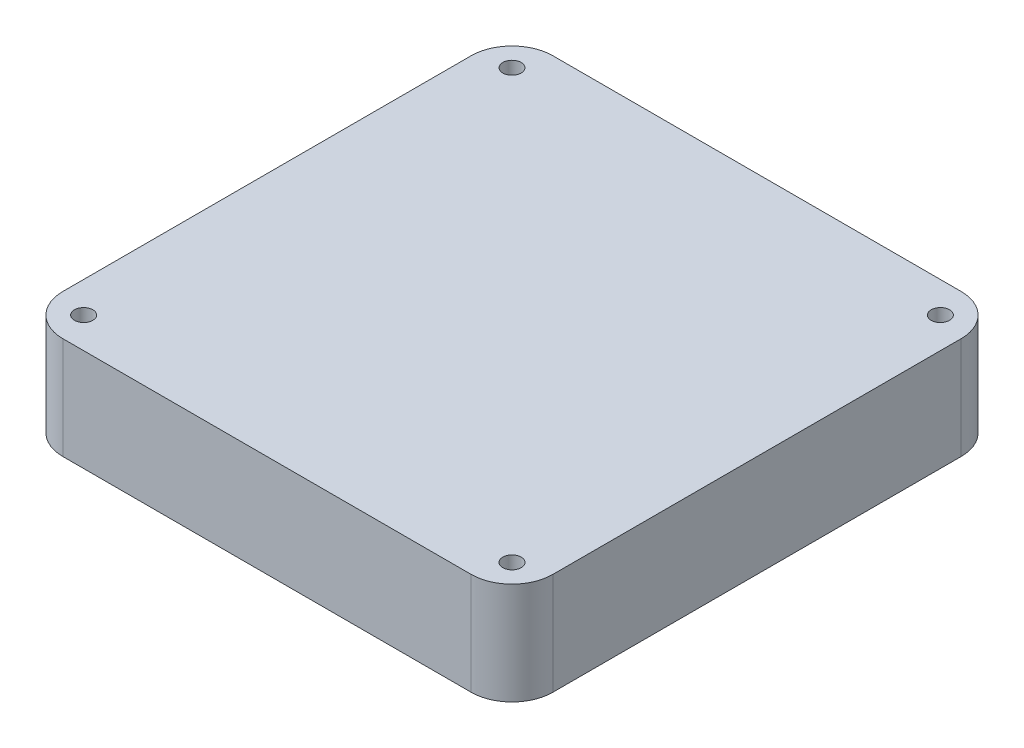
ISO-10303-21;
HEADER;
FILE_DESCRIPTION(('STEP AP214'),'2;1');
FILE_NAME('part.step','',(''),(''),'','','');
FILE_SCHEMA(('AUTOMOTIVE_DESIGN { 1 0 10303 214 1 1 1 1 }'));
ENDSEC;
DATA;
#1=APPLICATION_CONTEXT('core data for automotive mechanical design processes');
#2=APPLICATION_PROTOCOL_DEFINITION('international standard','automotive_design',2000,#1);
#3=PRODUCT_CONTEXT('',#1,'mechanical');
#4=PRODUCT('Part','Part','',(#3));
#5=PRODUCT_RELATED_PRODUCT_CATEGORY('part','',(#4));
#6=PRODUCT_DEFINITION_FORMATION('','',#4);
#7=PRODUCT_DEFINITION_CONTEXT('part definition',#1,'design');
#8=PRODUCT_DEFINITION('design','',#6,#7);
#9=PRODUCT_DEFINITION_SHAPE('','',#8);
#10=(LENGTH_UNIT() NAMED_UNIT(*) SI_UNIT(.MILLI.,.METRE.));
#11=(NAMED_UNIT(*) PLANE_ANGLE_UNIT() SI_UNIT($,.RADIAN.));
#12=(NAMED_UNIT(*) SI_UNIT($,.STERADIAN.) SOLID_ANGLE_UNIT());
#13=UNCERTAINTY_MEASURE_WITH_UNIT(LENGTH_MEASURE(1.E-05),#10,'distance_accuracy_value','');
#14=(GEOMETRIC_REPRESENTATION_CONTEXT(3) GLOBAL_UNCERTAINTY_ASSIGNED_CONTEXT((#13)) GLOBAL_UNIT_ASSIGNED_CONTEXT((#10,
#11,#12)) REPRESENTATION_CONTEXT('',''));
#15=CARTESIAN_POINT('',(0.,0.,0.));
#16=DIRECTION('',(0.,0.,1.));
#17=DIRECTION('',(1.,0.,0.));
#18=AXIS2_PLACEMENT_3D('',#15,#16,#17);
#19=CARTESIAN_POINT('',(0.,25.,0.));
#20=DIRECTION('',(0.,-1.,0.));
#21=DIRECTION('',(0.,0.,-1.));
#22=AXIS2_PLACEMENT_3D('',#19,#20,#21);
#23=PLANE('',#22);
#24=DIRECTION('',(-1.,0.,0.));
#25=VECTOR('',#24,1.);
#26=CARTESIAN_POINT('',(0.,25.,-120.));
#27=LINE('',#26,#25);
#28=CARTESIAN_POINT('',(110.,25.,-120.));
#29=VERTEX_POINT('',#28);
#30=CARTESIAN_POINT('',(10.,25.,-120.));
#31=VERTEX_POINT('',#30);
#32=EDGE_CURVE('E148',#29,#31,#27,.T.);
#33=ORIENTED_EDGE('',*,*,#32,.T.);
#34=CARTESIAN_POINT('',(10.,25.,-110.));
#35=DIRECTION('',(0.,-1.,0.));
#36=DIRECTION('',(0.,0.,-1.));
#37=AXIS2_PLACEMENT_3D('',#34,#35,#36);
#38=CIRCLE('',#37,10.);
#39=CARTESIAN_POINT('',(0.,25.,-110.));
#40=VERTEX_POINT('',#39);
#41=EDGE_CURVE('E178',#31,#40,#38,.F.);
#42=ORIENTED_EDGE('',*,*,#41,.T.);
#43=DIRECTION('',(0.,0.,1.));
#44=VECTOR('',#43,1.);
#45=CARTESIAN_POINT('',(0.,25.,0.));
#46=LINE('',#45,#44);
#47=CARTESIAN_POINT('',(0.,25.,-10.));
#48=VERTEX_POINT('',#47);
#49=EDGE_CURVE('E127',#40,#48,#46,.T.);
#50=ORIENTED_EDGE('',*,*,#49,.T.);
#51=CARTESIAN_POINT('',(10.,25.,-10.));
#52=DIRECTION('',(0.,-1.,0.));
#53=DIRECTION('',(0.,0.,-1.));
#54=AXIS2_PLACEMENT_3D('',#51,#52,#53);
#55=CIRCLE('',#54,10.);
#56=CARTESIAN_POINT('',(10.,25.,0.));
#57=VERTEX_POINT('',#56);
#58=EDGE_CURVE('E170',#48,#57,#55,.F.);
#59=ORIENTED_EDGE('',*,*,#58,.T.);
#60=DIRECTION('',(1.,0.,0.));
#61=VECTOR('',#60,1.);
#62=CARTESIAN_POINT('',(0.,25.,0.));
#63=LINE('',#62,#61);
#64=CARTESIAN_POINT('',(110.,25.,0.));
#65=VERTEX_POINT('',#64);
#66=EDGE_CURVE('E193',#57,#65,#63,.T.);
#67=ORIENTED_EDGE('',*,*,#66,.T.);
#68=CARTESIAN_POINT('',(110.,25.,-10.));
#69=DIRECTION('',(0.,-1.,0.));
#70=DIRECTION('',(0.,0.,-1.));
#71=AXIS2_PLACEMENT_3D('',#68,#69,#70);
#72=CIRCLE('',#71,10.);
#73=CARTESIAN_POINT('',(120.,25.,-10.));
#74=VERTEX_POINT('',#73);
#75=EDGE_CURVE('E62',#65,#74,#72,.F.);
#76=ORIENTED_EDGE('',*,*,#75,.T.);
#77=DIRECTION('',(0.,0.,-1.));
#78=VECTOR('',#77,1.);
#79=CARTESIAN_POINT('',(120.,25.,0.));
#80=LINE('',#79,#78);
#81=CARTESIAN_POINT('',(120.,25.,-110.));
#82=VERTEX_POINT('',#81);
#83=EDGE_CURVE('E201',#74,#82,#80,.T.);
#84=ORIENTED_EDGE('',*,*,#83,.T.);
#85=CARTESIAN_POINT('',(110.,25.,-110.));
#86=DIRECTION('',(0.,-1.,0.));
#87=DIRECTION('',(0.,0.,-1.));
#88=AXIS2_PLACEMENT_3D('',#85,#86,#87);
#89=CIRCLE('',#88,10.);
#90=EDGE_CURVE('E175',#82,#29,#89,.F.);
#91=ORIENTED_EDGE('',*,*,#90,.T.);
#92=EDGE_LOOP('',(#33,#42,#50,#59,#67,#76,#84,#91));
#93=FACE_BOUND('',#92,.T.);
#94=CARTESIAN_POINT('',(7.55,25.,-112.45));
#95=DIRECTION('',(0.,1.,0.));
#96=DIRECTION('',(0.,0.,1.));
#97=AXIS2_PLACEMENT_3D('',#94,#95,#96);
#98=CIRCLE('',#97,2.25);
#99=CARTESIAN_POINT('',(7.55,25.,-110.2));
#100=VERTEX_POINT('',#99);
#101=EDGE_CURVE('E137',#100,#100,#98,.T.);
#102=ORIENTED_EDGE('',*,*,#101,.F.);
#103=EDGE_LOOP('',(#102));
#104=FACE_BOUND('',#103,.T.);
#105=CARTESIAN_POINT('',(112.45,25.,-112.45));
#106=DIRECTION('',(0.,1.,0.));
#107=DIRECTION('',(0.,0.,1.));
#108=AXIS2_PLACEMENT_3D('',#105,#106,#107);
#109=CIRCLE('',#108,2.25);
#110=CARTESIAN_POINT('',(112.45,25.,-110.2));
#111=VERTEX_POINT('',#110);
#112=EDGE_CURVE('E213',#111,#111,#109,.T.);
#113=ORIENTED_EDGE('',*,*,#112,.F.);
#114=EDGE_LOOP('',(#113));
#115=FACE_BOUND('',#114,.T.);
#116=CARTESIAN_POINT('',(112.45,25.,-7.55));
#117=DIRECTION('',(0.,1.,0.));
#118=DIRECTION('',(0.,0.,1.));
#119=AXIS2_PLACEMENT_3D('',#116,#117,#118);
#120=CIRCLE('',#119,2.25);
#121=CARTESIAN_POINT('',(112.45,25.,-5.3));
#122=VERTEX_POINT('',#121);
#123=EDGE_CURVE('E219',#122,#122,#120,.T.);
#124=ORIENTED_EDGE('',*,*,#123,.F.);
#125=EDGE_LOOP('',(#124));
#126=FACE_BOUND('',#125,.T.);
#127=CARTESIAN_POINT('',(7.55,25.,-7.55));
#128=DIRECTION('',(0.,1.,0.));
#129=DIRECTION('',(0.,0.,1.));
#130=AXIS2_PLACEMENT_3D('',#127,#128,#129);
#131=CIRCLE('',#130,2.25);
#132=CARTESIAN_POINT('',(7.55,25.,-5.29999999999999));
#133=VERTEX_POINT('',#132);
#134=EDGE_CURVE('E227',#133,#133,#131,.T.);
#135=ORIENTED_EDGE('',*,*,#134,.F.);
#136=EDGE_LOOP('',(#135));
#137=FACE_BOUND('',#136,.T.);
#138=ADVANCED_FACE('F39',(#93,#104,#115,#126,#137),#23,.F.);
#139=CARTESIAN_POINT('',(0.,0.,0.));
#140=DIRECTION('',(0.,-1.,0.));
#141=DIRECTION('',(0.,0.,-1.));
#142=AXIS2_PLACEMENT_3D('',#139,#140,#141);
#143=PLANE('',#142);
#144=CARTESIAN_POINT('',(112.45,0.,-7.55));
#145=DIRECTION('',(0.,1.,0.));
#146=DIRECTION('',(0.,0.,1.));
#147=AXIS2_PLACEMENT_3D('',#144,#145,#146);
#148=CIRCLE('',#147,2.25);
#149=CARTESIAN_POINT('',(112.45,0.,-5.3));
#150=VERTEX_POINT('',#149);
#151=EDGE_CURVE('E223',#150,#150,#148,.T.);
#152=ORIENTED_EDGE('',*,*,#151,.T.);
#153=EDGE_LOOP('',(#152));
#154=FACE_BOUND('',#153,.T.);
#155=CARTESIAN_POINT('',(7.55,0.,-112.45));
#156=DIRECTION('',(0.,1.,0.));
#157=DIRECTION('',(0.,0.,1.));
#158=AXIS2_PLACEMENT_3D('',#155,#156,#157);
#159=CIRCLE('',#158,2.25);
#160=CARTESIAN_POINT('',(7.55,0.,-110.2));
#161=VERTEX_POINT('',#160);
#162=EDGE_CURVE('E145',#161,#161,#159,.T.);
#163=ORIENTED_EDGE('',*,*,#162,.T.);
#164=EDGE_LOOP('',(#163));
#165=FACE_BOUND('',#164,.T.);
#166=DIRECTION('',(0.,0.,1.));
#167=VECTOR('',#166,1.);
#168=CARTESIAN_POINT('',(0.,0.,0.));
#169=LINE('',#168,#167);
#170=CARTESIAN_POINT('',(0.,0.,-110.));
#171=VERTEX_POINT('',#170);
#172=CARTESIAN_POINT('',(0.,0.,-10.));
#173=VERTEX_POINT('',#172);
#174=EDGE_CURVE('E124',#171,#173,#169,.T.);
#175=ORIENTED_EDGE('',*,*,#174,.F.);
#176=CARTESIAN_POINT('',(10.,0.,-110.));
#177=DIRECTION('',(0.,-1.,0.));
#178=DIRECTION('',(0.,0.,-1.));
#179=AXIS2_PLACEMENT_3D('',#176,#177,#178);
#180=CIRCLE('',#179,10.);
#181=CARTESIAN_POINT('',(10.,0.,-120.));
#182=VERTEX_POINT('',#181);
#183=EDGE_CURVE('E106',#171,#182,#180,.T.);
#184=ORIENTED_EDGE('',*,*,#183,.T.);
#185=DIRECTION('',(-1.,0.,0.));
#186=VECTOR('',#185,1.);
#187=CARTESIAN_POINT('',(0.,0.,-120.));
#188=LINE('',#187,#186);
#189=CARTESIAN_POINT('',(110.,0.,-120.));
#190=VERTEX_POINT('',#189);
#191=EDGE_CURVE('E153',#190,#182,#188,.T.);
#192=ORIENTED_EDGE('',*,*,#191,.F.);
#193=CARTESIAN_POINT('',(110.,0.,-110.));
#194=DIRECTION('',(0.,-1.,0.));
#195=DIRECTION('',(0.,0.,-1.));
#196=AXIS2_PLACEMENT_3D('',#193,#194,#195);
#197=CIRCLE('',#196,10.);
#198=CARTESIAN_POINT('',(120.,0.,-110.));
#199=VERTEX_POINT('',#198);
#200=EDGE_CURVE('E118',#190,#199,#197,.T.);
#201=ORIENTED_EDGE('',*,*,#200,.T.);
#202=DIRECTION('',(0.,0.,-1.));
#203=VECTOR('',#202,1.);
#204=CARTESIAN_POINT('',(120.,0.,0.));
#205=LINE('',#204,#203);
#206=CARTESIAN_POINT('',(120.,0.,-10.));
#207=VERTEX_POINT('',#206);
#208=EDGE_CURVE('E142',#207,#199,#205,.T.);
#209=ORIENTED_EDGE('',*,*,#208,.F.);
#210=CARTESIAN_POINT('',(110.,0.,-10.));
#211=DIRECTION('',(0.,-1.,0.));
#212=DIRECTION('',(0.,0.,-1.));
#213=AXIS2_PLACEMENT_3D('',#210,#211,#212);
#214=CIRCLE('',#213,10.);
#215=CARTESIAN_POINT('',(110.,0.,0.));
#216=VERTEX_POINT('',#215);
#217=EDGE_CURVE('E160',#207,#216,#214,.T.);
#218=ORIENTED_EDGE('',*,*,#217,.T.);
#219=DIRECTION('',(1.,0.,0.));
#220=VECTOR('',#219,1.);
#221=CARTESIAN_POINT('',(0.,0.,0.));
#222=LINE('',#221,#220);
#223=CARTESIAN_POINT('',(10.,0.,0.));
#224=VERTEX_POINT('',#223);
#225=EDGE_CURVE('E136',#224,#216,#222,.T.);
#226=ORIENTED_EDGE('',*,*,#225,.F.);
#227=CARTESIAN_POINT('',(10.,0.,-10.));
#228=DIRECTION('',(0.,-1.,0.));
#229=DIRECTION('',(0.,0.,-1.));
#230=AXIS2_PLACEMENT_3D('',#227,#228,#229);
#231=CIRCLE('',#230,10.);
#232=EDGE_CURVE('E129',#224,#173,#231,.T.);
#233=ORIENTED_EDGE('',*,*,#232,.T.);
#234=EDGE_LOOP('',(#175,#184,#192,#201,#209,#218,#226,#233));
#235=FACE_BOUND('',#234,.T.);
#236=CARTESIAN_POINT('',(112.45,0.,-112.45));
#237=DIRECTION('',(0.,1.,0.));
#238=DIRECTION('',(0.,0.,1.));
#239=AXIS2_PLACEMENT_3D('',#236,#237,#238);
#240=CIRCLE('',#239,2.25);
#241=CARTESIAN_POINT('',(112.45,0.,-110.2));
#242=VERTEX_POINT('',#241);
#243=EDGE_CURVE('E215',#242,#242,#240,.T.);
#244=ORIENTED_EDGE('',*,*,#243,.T.);
#245=EDGE_LOOP('',(#244));
#246=FACE_BOUND('',#245,.T.);
#247=CARTESIAN_POINT('',(7.55,0.,-7.55));
#248=DIRECTION('',(0.,1.,0.));
#249=DIRECTION('',(0.,0.,1.));
#250=AXIS2_PLACEMENT_3D('',#247,#248,#249);
#251=CIRCLE('',#250,2.25);
#252=CARTESIAN_POINT('',(7.55,0.,-5.29999999999999));
#253=VERTEX_POINT('',#252);
#254=EDGE_CURVE('E231',#253,#253,#251,.T.);
#255=ORIENTED_EDGE('',*,*,#254,.T.);
#256=EDGE_LOOP('',(#255));
#257=FACE_BOUND('',#256,.T.);
#258=ADVANCED_FACE('F132',(#154,#165,#235,#246,#257),#143,.T.);
#259=CARTESIAN_POINT('',(0.,25.,0.));
#260=DIRECTION('',(1.,0.,0.));
#261=DIRECTION('',(0.,0.,-1.));
#262=AXIS2_PLACEMENT_3D('',#259,#260,#261);
#263=PLANE('',#262);
#264=ORIENTED_EDGE('',*,*,#49,.F.);
#265=DIRECTION('',(0.,-1.,0.));
#266=VECTOR('',#265,1.);
#267=CARTESIAN_POINT('',(0.,25.,-110.));
#268=LINE('',#267,#266);
#269=EDGE_CURVE('E110',#40,#171,#268,.T.);
#270=ORIENTED_EDGE('',*,*,#269,.T.);
#271=ORIENTED_EDGE('',*,*,#174,.T.);
#272=DIRECTION('',(0.,-1.,0.));
#273=VECTOR('',#272,1.);
#274=CARTESIAN_POINT('',(0.,25.,-10.));
#275=LINE('',#274,#273);
#276=EDGE_CURVE('E130',#173,#48,#275,.F.);
#277=ORIENTED_EDGE('',*,*,#276,.T.);
#278=EDGE_LOOP('',(#264,#270,#271,#277));
#279=FACE_BOUND('',#278,.T.);
#280=ADVANCED_FACE('F123',(#279),#263,.F.);
#281=CARTESIAN_POINT('',(0.,25.,0.));
#282=DIRECTION('',(0.,0.,-1.));
#283=DIRECTION('',(-1.,0.,0.));
#284=AXIS2_PLACEMENT_3D('',#281,#282,#283);
#285=PLANE('',#284);
#286=ORIENTED_EDGE('',*,*,#225,.T.);
#287=DIRECTION('',(0.,-1.,0.));
#288=VECTOR('',#287,1.);
#289=CARTESIAN_POINT('',(110.,25.,0.));
#290=LINE('',#289,#288);
#291=EDGE_CURVE('E11',#216,#65,#290,.F.);
#292=ORIENTED_EDGE('',*,*,#291,.T.);
#293=ORIENTED_EDGE('',*,*,#66,.F.);
#294=DIRECTION('',(0.,-1.,0.));
#295=VECTOR('',#294,1.);
#296=CARTESIAN_POINT('',(10.,25.,0.));
#297=LINE('',#296,#295);
#298=EDGE_CURVE('E48',#57,#224,#297,.T.);
#299=ORIENTED_EDGE('',*,*,#298,.T.);
#300=EDGE_LOOP('',(#286,#292,#293,#299));
#301=FACE_BOUND('',#300,.T.);
#302=ADVANCED_FACE('F191',(#301),#285,.F.);
#303=CARTESIAN_POINT('',(120.,25.,0.));
#304=DIRECTION('',(-1.,0.,0.));
#305=DIRECTION('',(0.,0.,1.));
#306=AXIS2_PLACEMENT_3D('',#303,#304,#305);
#307=PLANE('',#306);
#308=ORIENTED_EDGE('',*,*,#208,.T.);
#309=DIRECTION('',(0.,-1.,0.));
#310=VECTOR('',#309,1.);
#311=CARTESIAN_POINT('',(120.,25.,-110.));
#312=LINE('',#311,#310);
#313=EDGE_CURVE('E55',#199,#82,#312,.F.);
#314=ORIENTED_EDGE('',*,*,#313,.T.);
#315=ORIENTED_EDGE('',*,*,#83,.F.);
#316=DIRECTION('',(0.,-1.,0.));
#317=VECTOR('',#316,1.);
#318=CARTESIAN_POINT('',(120.,25.,-10.));
#319=LINE('',#318,#317);
#320=EDGE_CURVE('E181',#74,#207,#319,.T.);
#321=ORIENTED_EDGE('',*,*,#320,.T.);
#322=EDGE_LOOP('',(#308,#314,#315,#321));
#323=FACE_BOUND('',#322,.T.);
#324=ADVANCED_FACE('F200',(#323),#307,.F.);
#325=CARTESIAN_POINT('',(0.,25.,-120.));
#326=DIRECTION('',(0.,0.,1.));
#327=DIRECTION('',(1.,0.,0.));
#328=AXIS2_PLACEMENT_3D('',#325,#326,#327);
#329=PLANE('',#328);
#330=ORIENTED_EDGE('',*,*,#191,.T.);
#331=DIRECTION('',(0.,-1.,0.));
#332=VECTOR('',#331,1.);
#333=CARTESIAN_POINT('',(10.,25.,-120.));
#334=LINE('',#333,#332);
#335=EDGE_CURVE('E111',#182,#31,#334,.F.);
#336=ORIENTED_EDGE('',*,*,#335,.T.);
#337=ORIENTED_EDGE('',*,*,#32,.F.);
#338=DIRECTION('',(0.,-1.,0.));
#339=VECTOR('',#338,1.);
#340=CARTESIAN_POINT('',(110.,25.,-120.));
#341=LINE('',#340,#339);
#342=EDGE_CURVE('E117',#29,#190,#341,.T.);
#343=ORIENTED_EDGE('',*,*,#342,.T.);
#344=EDGE_LOOP('',(#330,#336,#337,#343));
#345=FACE_BOUND('',#344,.T.);
#346=ADVANCED_FACE('F254',(#345),#329,.F.);
#347=CARTESIAN_POINT('',(7.55,25.,-112.45));
#348=DIRECTION('',(0.,-1.,0.));
#349=DIRECTION('',(0.,0.,-1.));
#350=AXIS2_PLACEMENT_3D('',#347,#348,#349);
#351=CYLINDRICAL_SURFACE('',#350,2.25);
#352=ORIENTED_EDGE('',*,*,#101,.T.);
#353=EDGE_LOOP('',(#352));
#354=FACE_BOUND('',#353,.T.);
#355=ORIENTED_EDGE('',*,*,#162,.F.);
#356=EDGE_LOOP('',(#355));
#357=FACE_BOUND('',#356,.T.);
#358=ADVANCED_FACE('F251',(#354,#357),#351,.F.);
#359=CARTESIAN_POINT('',(112.45,25.,-112.45));
#360=DIRECTION('',(0.,-1.,0.));
#361=DIRECTION('',(0.,0.,-1.));
#362=AXIS2_PLACEMENT_3D('',#359,#360,#361);
#363=CYLINDRICAL_SURFACE('',#362,2.25);
#364=ORIENTED_EDGE('',*,*,#112,.T.);
#365=EDGE_LOOP('',(#364));
#366=FACE_BOUND('',#365,.T.);
#367=ORIENTED_EDGE('',*,*,#243,.F.);
#368=EDGE_LOOP('',(#367));
#369=FACE_BOUND('',#368,.T.);
#370=ADVANCED_FACE('F347',(#366,#369),#363,.F.);
#371=CARTESIAN_POINT('',(112.45,25.,-7.55));
#372=DIRECTION('',(0.,-1.,0.));
#373=DIRECTION('',(0.,0.,-1.));
#374=AXIS2_PLACEMENT_3D('',#371,#372,#373);
#375=CYLINDRICAL_SURFACE('',#374,2.25);
#376=ORIENTED_EDGE('',*,*,#123,.T.);
#377=EDGE_LOOP('',(#376));
#378=FACE_BOUND('',#377,.T.);
#379=ORIENTED_EDGE('',*,*,#151,.F.);
#380=EDGE_LOOP('',(#379));
#381=FACE_BOUND('',#380,.T.);
#382=ADVANCED_FACE('F338',(#378,#381),#375,.F.);
#383=CARTESIAN_POINT('',(7.55,25.,-7.55));
#384=DIRECTION('',(0.,-1.,0.));
#385=DIRECTION('',(0.,0.,-1.));
#386=AXIS2_PLACEMENT_3D('',#383,#384,#385);
#387=CYLINDRICAL_SURFACE('',#386,2.25);
#388=ORIENTED_EDGE('',*,*,#134,.T.);
#389=EDGE_LOOP('',(#388));
#390=FACE_BOUND('',#389,.T.);
#391=ORIENTED_EDGE('',*,*,#254,.F.);
#392=EDGE_LOOP('',(#391));
#393=FACE_BOUND('',#392,.T.);
#394=ADVANCED_FACE('F239',(#390,#393),#387,.F.);
#395=CARTESIAN_POINT('',(10.,25.,-110.));
#396=DIRECTION('',(0.,-1.,0.));
#397=DIRECTION('',(0.,0.,-1.));
#398=AXIS2_PLACEMENT_3D('',#395,#396,#397);
#399=CYLINDRICAL_SURFACE('',#398,10.);
#400=ORIENTED_EDGE('',*,*,#41,.F.);
#401=ORIENTED_EDGE('',*,*,#335,.F.);
#402=ORIENTED_EDGE('',*,*,#183,.F.);
#403=ORIENTED_EDGE('',*,*,#269,.F.);
#404=EDGE_LOOP('',(#400,#401,#402,#403));
#405=FACE_BOUND('',#404,.T.);
#406=ADVANCED_FACE('F109',(#405),#399,.T.);
#407=CARTESIAN_POINT('',(110.,25.,-110.));
#408=DIRECTION('',(0.,-1.,0.));
#409=DIRECTION('',(0.,0.,-1.));
#410=AXIS2_PLACEMENT_3D('',#407,#408,#409);
#411=CYLINDRICAL_SURFACE('',#410,10.);
#412=ORIENTED_EDGE('',*,*,#90,.F.);
#413=ORIENTED_EDGE('',*,*,#313,.F.);
#414=ORIENTED_EDGE('',*,*,#200,.F.);
#415=ORIENTED_EDGE('',*,*,#342,.F.);
#416=EDGE_LOOP('',(#412,#413,#414,#415));
#417=FACE_BOUND('',#416,.T.);
#418=ADVANCED_FACE('F266',(#417),#411,.T.);
#419=CARTESIAN_POINT('',(110.,25.,-10.));
#420=DIRECTION('',(0.,-1.,0.));
#421=DIRECTION('',(0.,0.,-1.));
#422=AXIS2_PLACEMENT_3D('',#419,#420,#421);
#423=CYLINDRICAL_SURFACE('',#422,10.);
#424=ORIENTED_EDGE('',*,*,#75,.F.);
#425=ORIENTED_EDGE('',*,*,#291,.F.);
#426=ORIENTED_EDGE('',*,*,#217,.F.);
#427=ORIENTED_EDGE('',*,*,#320,.F.);
#428=EDGE_LOOP('',(#424,#425,#426,#427));
#429=FACE_BOUND('',#428,.T.);
#430=ADVANCED_FACE('F199',(#429),#423,.T.);
#431=CARTESIAN_POINT('',(10.,25.,-10.));
#432=DIRECTION('',(0.,-1.,0.));
#433=DIRECTION('',(0.,0.,-1.));
#434=AXIS2_PLACEMENT_3D('',#431,#432,#433);
#435=CYLINDRICAL_SURFACE('',#434,10.);
#436=ORIENTED_EDGE('',*,*,#58,.F.);
#437=ORIENTED_EDGE('',*,*,#276,.F.);
#438=ORIENTED_EDGE('',*,*,#232,.F.);
#439=ORIENTED_EDGE('',*,*,#298,.F.);
#440=EDGE_LOOP('',(#436,#437,#438,#439));
#441=FACE_BOUND('',#440,.T.);
#442=ADVANCED_FACE('F41',(#441),#435,.T.);
#443=CLOSED_SHELL('',(#138,#258,#280,#302,#324,#346,#358,#370,#382,#394,#406,#418,#430,#442));
#444=MANIFOLD_SOLID_BREP('B2',#443);
#445=ADVANCED_BREP_SHAPE_REPRESENTATION('',(#18,#444),#14);
#446=SHAPE_DEFINITION_REPRESENTATION(#9,#445);
ENDSEC;
END-ISO-10303-21;
